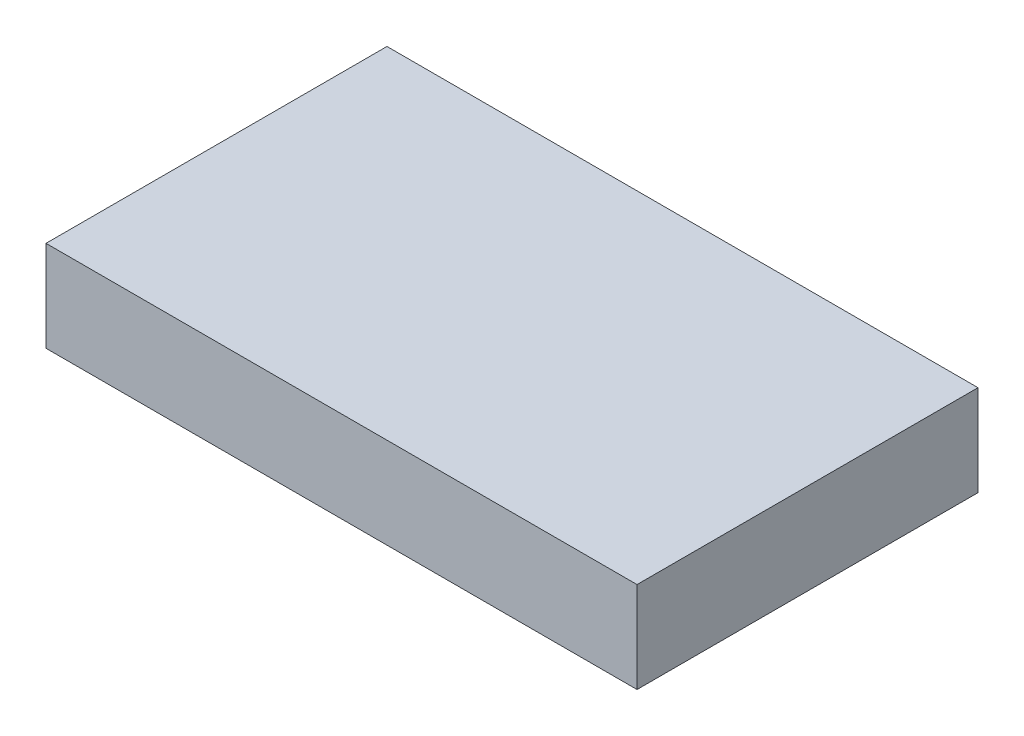
ISO-10303-21;
HEADER;
FILE_DESCRIPTION(('STEP AP214'),'2;1');
FILE_NAME('part.step','',(''),(''),'','','');
FILE_SCHEMA(('AUTOMOTIVE_DESIGN { 1 0 10303 214 1 1 1 1 }'));
ENDSEC;
DATA;
#1=APPLICATION_CONTEXT('core data for automotive mechanical design processes');
#2=APPLICATION_PROTOCOL_DEFINITION('international standard','automotive_design',2000,#1);
#3=PRODUCT_CONTEXT('',#1,'mechanical');
#4=PRODUCT('Part','Part','',(#3));
#5=PRODUCT_RELATED_PRODUCT_CATEGORY('part','',(#4));
#6=PRODUCT_DEFINITION_FORMATION('','',#4);
#7=PRODUCT_DEFINITION_CONTEXT('part definition',#1,'design');
#8=PRODUCT_DEFINITION('design','',#6,#7);
#9=PRODUCT_DEFINITION_SHAPE('','',#8);
#10=(LENGTH_UNIT() NAMED_UNIT(*) SI_UNIT(.MILLI.,.METRE.));
#11=(NAMED_UNIT(*) PLANE_ANGLE_UNIT() SI_UNIT($,.RADIAN.));
#12=(NAMED_UNIT(*) SI_UNIT($,.STERADIAN.) SOLID_ANGLE_UNIT());
#13=UNCERTAINTY_MEASURE_WITH_UNIT(LENGTH_MEASURE(1.E-05),#10,'distance_accuracy_value','');
#14=(GEOMETRIC_REPRESENTATION_CONTEXT(3) GLOBAL_UNCERTAINTY_ASSIGNED_CONTEXT((#13)) GLOBAL_UNIT_ASSIGNED_CONTEXT((#10,
#11,#12)) REPRESENTATION_CONTEXT('',''));
#15=CARTESIAN_POINT('',(0.,0.,0.));
#16=DIRECTION('',(0.,0.,1.));
#17=DIRECTION('',(1.,0.,0.));
#18=AXIS2_PLACEMENT_3D('',#15,#16,#17);
#19=CARTESIAN_POINT('',(-27.5490330972684,8.,-19.8126607891314));
#20=DIRECTION('',(1.,0.,0.));
#21=DIRECTION('',(0.,0.,-1.));
#22=AXIS2_PLACEMENT_3D('',#19,#20,#21);
#23=PLANE('',#22);
#24=DIRECTION('',(0.,0.,1.));
#25=VECTOR('',#24,1.);
#26=CARTESIAN_POINT('',(-27.5490330972684,0.,-19.8126607891314));
#27=LINE('',#26,#25);
#28=CARTESIAN_POINT('',(-27.5490330972684,0.,-19.8126607891314));
#29=VERTEX_POINT('',#28);
#30=CARTESIAN_POINT('',(-27.5490330972684,0.,10.1873392108686));
#31=VERTEX_POINT('',#30);
#32=EDGE_CURVE('E99',#29,#31,#27,.T.);
#33=ORIENTED_EDGE('',*,*,#32,.T.);
#34=DIRECTION('',(0.,-1.,0.));
#35=VECTOR('',#34,1.);
#36=CARTESIAN_POINT('',(-27.5490330972684,8.,10.1873392108686));
#37=LINE('',#36,#35);
#38=CARTESIAN_POINT('',(-27.5490330972684,8.,10.1873392108686));
#39=VERTEX_POINT('',#38);
#40=EDGE_CURVE('E11',#39,#31,#37,.T.);
#41=ORIENTED_EDGE('',*,*,#40,.F.);
#42=DIRECTION('',(0.,0.,1.));
#43=VECTOR('',#42,1.);
#44=CARTESIAN_POINT('',(-27.5490330972684,8.,-19.8126607891314));
#45=LINE('',#44,#43);
#46=CARTESIAN_POINT('',(-27.5490330972684,8.,-19.8126607891314));
#47=VERTEX_POINT('',#46);
#48=EDGE_CURVE('E87',#47,#39,#45,.T.);
#49=ORIENTED_EDGE('',*,*,#48,.F.);
#50=DIRECTION('',(0.,-1.,0.));
#51=VECTOR('',#50,1.);
#52=CARTESIAN_POINT('',(-27.5490330972684,8.,-19.8126607891314));
#53=LINE('',#52,#51);
#54=EDGE_CURVE('E95',#47,#29,#53,.T.);
#55=ORIENTED_EDGE('',*,*,#54,.T.);
#56=EDGE_LOOP('',(#33,#41,#49,#55));
#57=FACE_BOUND('',#56,.T.);
#58=ADVANCED_FACE('F36',(#57),#23,.F.);
#59=CARTESIAN_POINT('',(-27.5490330972684,8.,10.1873392108686));
#60=DIRECTION('',(0.,0.,-1.));
#61=DIRECTION('',(-1.,0.,0.));
#62=AXIS2_PLACEMENT_3D('',#59,#60,#61);
#63=PLANE('',#62);
#64=DIRECTION('',(1.,0.,0.));
#65=VECTOR('',#64,1.);
#66=CARTESIAN_POINT('',(-27.5490330972684,0.,10.1873392108686));
#67=LINE('',#66,#65);
#68=CARTESIAN_POINT('',(24.4509669027316,0.,10.1873392108686));
#69=VERTEX_POINT('',#68);
#70=EDGE_CURVE('E91',#31,#69,#67,.T.);
#71=ORIENTED_EDGE('',*,*,#70,.T.);
#72=DIRECTION('',(0.,-1.,0.));
#73=VECTOR('',#72,1.);
#74=CARTESIAN_POINT('',(24.4509669027316,8.,10.1873392108686));
#75=LINE('',#74,#73);
#76=CARTESIAN_POINT('',(24.4509669027316,8.,10.1873392108686));
#77=VERTEX_POINT('',#76);
#78=EDGE_CURVE('E44',#77,#69,#75,.T.);
#79=ORIENTED_EDGE('',*,*,#78,.F.);
#80=DIRECTION('',(1.,0.,0.));
#81=VECTOR('',#80,1.);
#82=CARTESIAN_POINT('',(-27.5490330972684,8.,10.1873392108686));
#83=LINE('',#82,#81);
#84=EDGE_CURVE('E82',#39,#77,#83,.T.);
#85=ORIENTED_EDGE('',*,*,#84,.F.);
#86=ORIENTED_EDGE('',*,*,#40,.T.);
#87=EDGE_LOOP('',(#71,#79,#85,#86));
#88=FACE_BOUND('',#87,.T.);
#89=ADVANCED_FACE('F90',(#88),#63,.F.);
#90=CARTESIAN_POINT('',(24.4509669027316,8.,-19.8126607891314));
#91=DIRECTION('',(-1.,0.,0.));
#92=DIRECTION('',(0.,0.,1.));
#93=AXIS2_PLACEMENT_3D('',#90,#91,#92);
#94=PLANE('',#93);
#95=DIRECTION('',(0.,0.,-1.));
#96=VECTOR('',#95,1.);
#97=CARTESIAN_POINT('',(24.4509669027316,0.,-19.8126607891314));
#98=LINE('',#97,#96);
#99=CARTESIAN_POINT('',(24.4509669027316,0.,-19.8126607891314));
#100=VERTEX_POINT('',#99);
#101=EDGE_CURVE('E69',#69,#100,#98,.T.);
#102=ORIENTED_EDGE('',*,*,#101,.T.);
#103=DIRECTION('',(0.,-1.,0.));
#104=VECTOR('',#103,1.);
#105=CARTESIAN_POINT('',(24.4509669027316,8.,-19.8126607891314));
#106=LINE('',#105,#104);
#107=CARTESIAN_POINT('',(24.4509669027316,8.,-19.8126607891314));
#108=VERTEX_POINT('',#107);
#109=EDGE_CURVE('E92',#108,#100,#106,.T.);
#110=ORIENTED_EDGE('',*,*,#109,.F.);
#111=DIRECTION('',(0.,0.,-1.));
#112=VECTOR('',#111,1.);
#113=CARTESIAN_POINT('',(24.4509669027316,8.,-19.8126607891314));
#114=LINE('',#113,#112);
#115=EDGE_CURVE('E85',#77,#108,#114,.T.);
#116=ORIENTED_EDGE('',*,*,#115,.F.);
#117=ORIENTED_EDGE('',*,*,#78,.T.);
#118=EDGE_LOOP('',(#102,#110,#116,#117));
#119=FACE_BOUND('',#118,.T.);
#120=ADVANCED_FACE('F93',(#119),#94,.F.);
#121=CARTESIAN_POINT('',(-27.5490330972684,8.,-19.8126607891314));
#122=DIRECTION('',(0.,0.,1.));
#123=DIRECTION('',(1.,0.,0.));
#124=AXIS2_PLACEMENT_3D('',#121,#122,#123);
#125=PLANE('',#124);
#126=DIRECTION('',(-1.,0.,0.));
#127=VECTOR('',#126,1.);
#128=CARTESIAN_POINT('',(-27.5490330972684,0.,-19.8126607891314));
#129=LINE('',#128,#127);
#130=EDGE_CURVE('E75',#100,#29,#129,.T.);
#131=ORIENTED_EDGE('',*,*,#130,.T.);
#132=ORIENTED_EDGE('',*,*,#54,.F.);
#133=DIRECTION('',(-1.,0.,0.));
#134=VECTOR('',#133,1.);
#135=CARTESIAN_POINT('',(-27.5490330972684,8.,-19.8126607891314));
#136=LINE('',#135,#134);
#137=EDGE_CURVE('E52',#108,#47,#136,.T.);
#138=ORIENTED_EDGE('',*,*,#137,.F.);
#139=ORIENTED_EDGE('',*,*,#109,.T.);
#140=EDGE_LOOP('',(#131,#132,#138,#139));
#141=FACE_BOUND('',#140,.T.);
#142=ADVANCED_FACE('F106',(#141),#125,.F.);
#143=CARTESIAN_POINT('',(0.,8.,0.));
#144=DIRECTION('',(0.,1.,0.));
#145=DIRECTION('',(0.,0.,1.));
#146=AXIS2_PLACEMENT_3D('',#143,#144,#145);
#147=PLANE('',#146);
#148=ORIENTED_EDGE('',*,*,#48,.T.);
#149=ORIENTED_EDGE('',*,*,#84,.T.);
#150=ORIENTED_EDGE('',*,*,#115,.T.);
#151=ORIENTED_EDGE('',*,*,#137,.T.);
#152=EDGE_LOOP('',(#148,#149,#150,#151));
#153=FACE_BOUND('',#152,.T.);
#154=ADVANCED_FACE('F83',(#153),#147,.T.);
#155=CARTESIAN_POINT('',(0.,0.,0.));
#156=DIRECTION('',(0.,1.,0.));
#157=DIRECTION('',(0.,0.,1.));
#158=AXIS2_PLACEMENT_3D('',#155,#156,#157);
#159=PLANE('',#158);
#160=ORIENTED_EDGE('',*,*,#32,.F.);
#161=ORIENTED_EDGE('',*,*,#130,.F.);
#162=ORIENTED_EDGE('',*,*,#101,.F.);
#163=ORIENTED_EDGE('',*,*,#70,.F.);
#164=EDGE_LOOP('',(#160,#161,#162,#163));
#165=FACE_BOUND('',#164,.T.);
#166=ADVANCED_FACE('F109',(#165),#159,.F.);
#167=CLOSED_SHELL('',(#58,#89,#120,#142,#154,#166));
#168=MANIFOLD_SOLID_BREP('B2',#167);
#169=ADVANCED_BREP_SHAPE_REPRESENTATION('',(#18,#168),#14);
#170=SHAPE_DEFINITION_REPRESENTATION(#9,#169);
ENDSEC;
END-ISO-10303-21;
